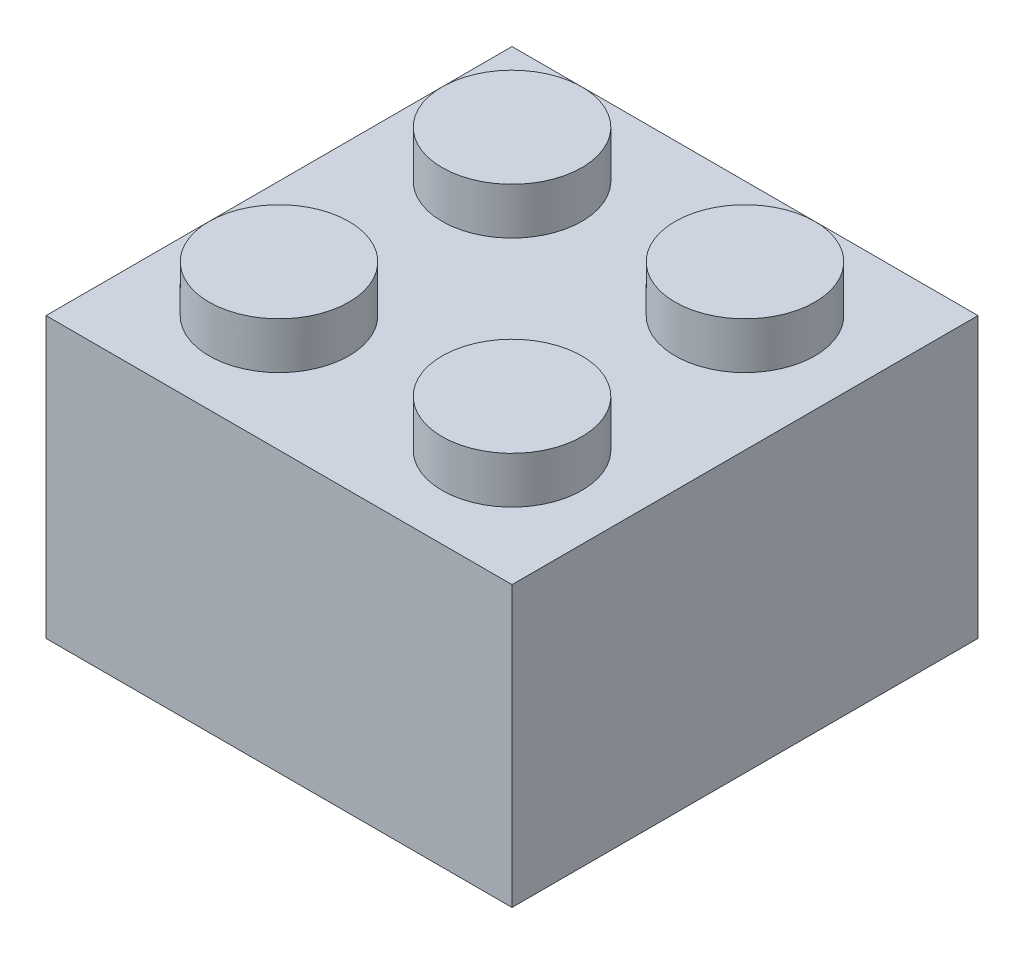
ISO-10303-21;
HEADER;
FILE_DESCRIPTION(('STEP AP214'),'2;1');
FILE_NAME('part.step','',(''),(''),'','','');
FILE_SCHEMA(('AUTOMOTIVE_DESIGN { 1 0 10303 214 1 1 1 1 }'));
ENDSEC;
DATA;
#1=APPLICATION_CONTEXT('core data for automotive mechanical design processes');
#2=APPLICATION_PROTOCOL_DEFINITION('international standard','automotive_design',2000,#1);
#3=PRODUCT_CONTEXT('',#1,'mechanical');
#4=PRODUCT('Part','Part','',(#3));
#5=PRODUCT_RELATED_PRODUCT_CATEGORY('part','',(#4));
#6=PRODUCT_DEFINITION_FORMATION('','',#4);
#7=PRODUCT_DEFINITION_CONTEXT('part definition',#1,'design');
#8=PRODUCT_DEFINITION('design','',#6,#7);
#9=PRODUCT_DEFINITION_SHAPE('','',#8);
#10=(LENGTH_UNIT() NAMED_UNIT(*) SI_UNIT(.MILLI.,.METRE.));
#11=(NAMED_UNIT(*) PLANE_ANGLE_UNIT() SI_UNIT($,.RADIAN.));
#12=(NAMED_UNIT(*) SI_UNIT($,.STERADIAN.) SOLID_ANGLE_UNIT());
#13=UNCERTAINTY_MEASURE_WITH_UNIT(LENGTH_MEASURE(1.E-05),#10,'distance_accuracy_value','');
#14=(GEOMETRIC_REPRESENTATION_CONTEXT(3) GLOBAL_UNCERTAINTY_ASSIGNED_CONTEXT((#13)) GLOBAL_UNIT_ASSIGNED_CONTEXT((#10,
#11,#12)) REPRESENTATION_CONTEXT('',''));
#15=CARTESIAN_POINT('',(0.,0.,0.));
#16=DIRECTION('',(0.,0.,1.));
#17=DIRECTION('',(1.,0.,0.));
#18=AXIS2_PLACEMENT_3D('',#15,#16,#17);
#19=CARTESIAN_POINT('',(1.,5.,500000.));
#20=DIRECTION('',(0.,1.,0.));
#21=DIRECTION('',(0.,0.,1.));
#22=AXIS2_PLACEMENT_3D('',#19,#20,#21);
#23=PLANE('',#22);
#24=CARTESIAN_POINT('',(2.5,5.,-7.5));
#25=DIRECTION('',(0.,-1.,0.));
#26=DIRECTION('',(0.,0.,-1.));
#27=AXIS2_PLACEMENT_3D('',#24,#25,#26);
#28=CIRCLE('',#27,0.75);
#29=CARTESIAN_POINT('',(2.5,5.,-8.25));
#30=VERTEX_POINT('',#29);
#31=EDGE_CURVE('E256',#30,#30,#28,.F.);
#32=ORIENTED_EDGE('',*,*,#31,.T.);
#33=EDGE_LOOP('',(#32));
#34=FACE_BOUND('',#33,.T.);
#35=DIRECTION('',(0.,0.,-1.));
#36=VECTOR('',#35,1.);
#37=CARTESIAN_POINT('',(9.,5.,500000.));
#38=LINE('',#37,#36);
#39=CARTESIAN_POINT('',(9.,5.,-0.999999999976353));
#40=VERTEX_POINT('',#39);
#41=CARTESIAN_POINT('',(9.,5.,-9.));
#42=VERTEX_POINT('',#41);
#43=EDGE_CURVE('E102',#40,#42,#38,.T.);
#44=ORIENTED_EDGE('',*,*,#43,.F.);
#45=DIRECTION('',(-1.,0.,0.));
#46=VECTOR('',#45,1.);
#47=CARTESIAN_POINT('',(1.,5.,-0.999999999976353));
#48=LINE('',#47,#46);
#49=CARTESIAN_POINT('',(1.,5.,-0.999999999976353));
#50=VERTEX_POINT('',#49);
#51=EDGE_CURVE('E99',#40,#50,#48,.T.);
#52=ORIENTED_EDGE('',*,*,#51,.T.);
#53=DIRECTION('',(0.,0.,-1.));
#54=VECTOR('',#53,1.);
#55=CARTESIAN_POINT('',(1.,5.,500000.));
#56=LINE('',#55,#54);
#57=CARTESIAN_POINT('',(1.,5.,-9.));
#58=VERTEX_POINT('',#57);
#59=EDGE_CURVE('E50',#50,#58,#56,.T.);
#60=ORIENTED_EDGE('',*,*,#59,.T.);
#61=DIRECTION('',(1.,0.,0.));
#62=VECTOR('',#61,1.);
#63=CARTESIAN_POINT('',(1.,5.,-9.));
#64=LINE('',#63,#62);
#65=EDGE_CURVE('E210',#58,#42,#64,.T.);
#66=ORIENTED_EDGE('',*,*,#65,.T.);
#67=EDGE_LOOP('',(#44,#52,#60,#66));
#68=FACE_BOUND('',#67,.T.);
#69=CARTESIAN_POINT('',(5.,5.,-4.99999999998818));
#70=DIRECTION('',(0.,1.,0.));
#71=DIRECTION('',(0.,0.,1.));
#72=AXIS2_PLACEMENT_3D('',#69,#70,#71);
#73=CIRCLE('',#72,2.03553390593274);
#74=CARTESIAN_POINT('',(5.,5.,-2.96446609405544));
#75=VERTEX_POINT('',#74);
#76=EDGE_CURVE('E11',#75,#75,#73,.F.);
#77=ORIENTED_EDGE('',*,*,#76,.F.);
#78=EDGE_LOOP('',(#77));
#79=FACE_BOUND('',#78,.T.);
#80=CARTESIAN_POINT('',(7.5,5.,-7.5));
#81=DIRECTION('',(0.,-1.,0.));
#82=DIRECTION('',(0.,0.,-1.));
#83=AXIS2_PLACEMENT_3D('',#80,#81,#82);
#84=CIRCLE('',#83,0.75);
#85=CARTESIAN_POINT('',(7.5,5.,-8.25));
#86=VERTEX_POINT('',#85);
#87=EDGE_CURVE('E238',#86,#86,#84,.T.);
#88=ORIENTED_EDGE('',*,*,#87,.F.);
#89=EDGE_LOOP('',(#88));
#90=FACE_BOUND('',#89,.T.);
#91=CARTESIAN_POINT('',(7.5,5.,-2.5));
#92=DIRECTION('',(0.,-1.,0.));
#93=DIRECTION('',(0.,0.,-1.));
#94=AXIS2_PLACEMENT_3D('',#91,#92,#93);
#95=CIRCLE('',#94,0.75);
#96=CARTESIAN_POINT('',(7.5,5.,-3.25));
#97=VERTEX_POINT('',#96);
#98=EDGE_CURVE('E244',#97,#97,#95,.F.);
#99=ORIENTED_EDGE('',*,*,#98,.T.);
#100=EDGE_LOOP('',(#99));
#101=FACE_BOUND('',#100,.T.);
#102=CARTESIAN_POINT('',(2.5,5.,-2.5));
#103=DIRECTION('',(0.,-1.,0.));
#104=DIRECTION('',(0.,0.,-1.));
#105=AXIS2_PLACEMENT_3D('',#102,#103,#104);
#106=CIRCLE('',#105,0.75);
#107=CARTESIAN_POINT('',(2.5,5.,-3.25));
#108=VERTEX_POINT('',#107);
#109=EDGE_CURVE('E250',#108,#108,#106,.T.);
#110=ORIENTED_EDGE('',*,*,#109,.F.);
#111=EDGE_LOOP('',(#110));
#112=FACE_BOUND('',#111,.T.);
#113=ADVANCED_FACE('F35',(#34,#68,#79,#90,#101,#112),#23,.F.);
#114=CARTESIAN_POINT('',(1.,6.,-1.));
#115=DIRECTION('',(1.,0.,0.));
#116=DIRECTION('',(0.,0.,-1.));
#117=AXIS2_PLACEMENT_3D('',#114,#115,#116);
#118=PLANE('',#117);
#119=DIRECTION('',(0.,-1.,0.));
#120=VECTOR('',#119,1.);
#121=CARTESIAN_POINT('',(1.,6.,-9.));
#122=LINE('',#121,#120);
#123=CARTESIAN_POINT('',(1.,0.,-9.));
#124=VERTEX_POINT('',#123);
#125=EDGE_CURVE('E57',#58,#124,#122,.T.);
#126=ORIENTED_EDGE('',*,*,#125,.F.);
#127=ORIENTED_EDGE('',*,*,#59,.F.);
#128=DIRECTION('',(0.,-1.,0.));
#129=VECTOR('',#128,1.);
#130=CARTESIAN_POINT('',(1.,6.,-1.));
#131=LINE('',#130,#129);
#132=CARTESIAN_POINT('',(1.,0.,-1.));
#133=VERTEX_POINT('',#132);
#134=EDGE_CURVE('E110',#50,#133,#131,.T.);
#135=ORIENTED_EDGE('',*,*,#134,.T.);
#136=DIRECTION('',(0.,0.,1.));
#137=VECTOR('',#136,1.);
#138=CARTESIAN_POINT('',(1.,0.,-1.));
#139=LINE('',#138,#137);
#140=EDGE_CURVE('E200',#124,#133,#139,.T.);
#141=ORIENTED_EDGE('',*,*,#140,.F.);
#142=EDGE_LOOP('',(#126,#127,#135,#141));
#143=FACE_BOUND('',#142,.T.);
#144=ADVANCED_FACE('F109',(#143),#118,.T.);
#145=CARTESIAN_POINT('',(1.,6.,-1.));
#146=DIRECTION('',(0.,0.,-1.));
#147=DIRECTION('',(-1.,0.,0.));
#148=AXIS2_PLACEMENT_3D('',#145,#146,#147);
#149=PLANE('',#148);
#150=ORIENTED_EDGE('',*,*,#134,.F.);
#151=ORIENTED_EDGE('',*,*,#51,.F.);
#152=DIRECTION('',(0.,-1.,0.));
#153=VECTOR('',#152,1.);
#154=CARTESIAN_POINT('',(9.,6.,-1.));
#155=LINE('',#154,#153);
#156=CARTESIAN_POINT('',(9.,0.,-1.));
#157=VERTEX_POINT('',#156);
#158=EDGE_CURVE('E118',#40,#157,#155,.T.);
#159=ORIENTED_EDGE('',*,*,#158,.T.);
#160=DIRECTION('',(1.,0.,0.));
#161=VECTOR('',#160,1.);
#162=CARTESIAN_POINT('',(1.,0.,-1.));
#163=LINE('',#162,#161);
#164=EDGE_CURVE('E115',#133,#157,#163,.T.);
#165=ORIENTED_EDGE('',*,*,#164,.F.);
#166=EDGE_LOOP('',(#150,#151,#159,#165));
#167=FACE_BOUND('',#166,.T.);
#168=ADVANCED_FACE('F113',(#167),#149,.T.);
#169=CARTESIAN_POINT('',(9.,6.,-1.));
#170=DIRECTION('',(-1.,0.,0.));
#171=DIRECTION('',(0.,0.,1.));
#172=AXIS2_PLACEMENT_3D('',#169,#170,#171);
#173=PLANE('',#172);
#174=ORIENTED_EDGE('',*,*,#158,.F.);
#175=ORIENTED_EDGE('',*,*,#43,.T.);
#176=DIRECTION('',(0.,-1.,0.));
#177=VECTOR('',#176,1.);
#178=CARTESIAN_POINT('',(9.,6.,-9.));
#179=LINE('',#178,#177);
#180=CARTESIAN_POINT('',(9.,0.,-9.));
#181=VERTEX_POINT('',#180);
#182=EDGE_CURVE('E123',#42,#181,#179,.T.);
#183=ORIENTED_EDGE('',*,*,#182,.T.);
#184=DIRECTION('',(0.,0.,-1.));
#185=VECTOR('',#184,1.);
#186=CARTESIAN_POINT('',(9.,0.,-1.));
#187=LINE('',#186,#185);
#188=EDGE_CURVE('E202',#157,#181,#187,.T.);
#189=ORIENTED_EDGE('',*,*,#188,.F.);
#190=EDGE_LOOP('',(#174,#175,#183,#189));
#191=FACE_BOUND('',#190,.T.);
#192=ADVANCED_FACE('F209',(#191),#173,.T.);
#193=CARTESIAN_POINT('',(1.,6.,-9.));
#194=DIRECTION('',(0.,0.,1.));
#195=DIRECTION('',(1.,0.,0.));
#196=AXIS2_PLACEMENT_3D('',#193,#194,#195);
#197=PLANE('',#196);
#198=ORIENTED_EDGE('',*,*,#182,.F.);
#199=ORIENTED_EDGE('',*,*,#65,.F.);
#200=ORIENTED_EDGE('',*,*,#125,.T.);
#201=DIRECTION('',(-1.,0.,0.));
#202=VECTOR('',#201,1.);
#203=CARTESIAN_POINT('',(1.,0.,-9.));
#204=LINE('',#203,#202);
#205=EDGE_CURVE('E199',#181,#124,#204,.T.);
#206=ORIENTED_EDGE('',*,*,#205,.F.);
#207=EDGE_LOOP('',(#198,#199,#200,#206));
#208=FACE_BOUND('',#207,.T.);
#209=ADVANCED_FACE('F164',(#208),#197,.T.);
#210=CARTESIAN_POINT('',(0.,6.,0.));
#211=DIRECTION('',(0.,-1.,0.));
#212=DIRECTION('',(0.,0.,-1.));
#213=AXIS2_PLACEMENT_3D('',#210,#211,#212);
#214=PLANE('',#213);
#215=CARTESIAN_POINT('',(2.5,6.,-2.5));
#216=DIRECTION('',(0.,-1.,0.));
#217=DIRECTION('',(0.,0.,-1.));
#218=AXIS2_PLACEMENT_3D('',#215,#216,#217);
#219=CIRCLE('',#218,1.5);
#220=CARTESIAN_POINT('',(2.5,6.,-4.));
#221=VERTEX_POINT('',#220);
#222=EDGE_CURVE('E43',#221,#221,#219,.F.);
#223=ORIENTED_EDGE('',*,*,#222,.F.);
#224=EDGE_LOOP('',(#223));
#225=FACE_BOUND('',#224,.T.);
#226=CARTESIAN_POINT('',(7.5,6.,-2.5));
#227=DIRECTION('',(0.,1.,0.));
#228=DIRECTION('',(0.,0.,1.));
#229=AXIS2_PLACEMENT_3D('',#226,#227,#228);
#230=CIRCLE('',#229,1.5);
#231=CARTESIAN_POINT('',(7.5,6.,-1.));
#232=VERTEX_POINT('',#231);
#233=EDGE_CURVE('E169',#232,#232,#230,.F.);
#234=ORIENTED_EDGE('',*,*,#233,.T.);
#235=EDGE_LOOP('',(#234));
#236=FACE_BOUND('',#235,.T.);
#237=CARTESIAN_POINT('',(7.5,6.,-7.5));
#238=DIRECTION('',(0.,-1.,0.));
#239=DIRECTION('',(0.,0.,-1.));
#240=AXIS2_PLACEMENT_3D('',#237,#238,#239);
#241=CIRCLE('',#240,1.5);
#242=CARTESIAN_POINT('',(7.5,6.,-9.));
#243=VERTEX_POINT('',#242);
#244=EDGE_CURVE('E153',#243,#243,#241,.F.);
#245=ORIENTED_EDGE('',*,*,#244,.F.);
#246=EDGE_LOOP('',(#245));
#247=FACE_BOUND('',#246,.T.);
#248=CARTESIAN_POINT('',(2.5,6.,-7.5));
#249=DIRECTION('',(0.,1.,0.));
#250=DIRECTION('',(0.,0.,1.));
#251=AXIS2_PLACEMENT_3D('',#248,#249,#250);
#252=CIRCLE('',#251,1.5);
#253=CARTESIAN_POINT('',(2.5,6.,-6.));
#254=VERTEX_POINT('',#253);
#255=EDGE_CURVE('E175',#254,#254,#252,.F.);
#256=ORIENTED_EDGE('',*,*,#255,.T.);
#257=EDGE_LOOP('',(#256));
#258=FACE_BOUND('',#257,.T.);
#259=DIRECTION('',(0.,0.,1.));
#260=VECTOR('',#259,1.);
#261=CARTESIAN_POINT('',(0.,6.,0.));
#262=LINE('',#261,#260);
#263=CARTESIAN_POINT('',(0.,6.,-10.));
#264=VERTEX_POINT('',#263);
#265=CARTESIAN_POINT('',(0.,6.,0.));
#266=VERTEX_POINT('',#265);
#267=EDGE_CURVE('E127',#264,#266,#262,.T.);
#268=ORIENTED_EDGE('',*,*,#267,.T.);
#269=DIRECTION('',(1.,0.,0.));
#270=VECTOR('',#269,1.);
#271=CARTESIAN_POINT('',(0.,6.,0.));
#272=LINE('',#271,#270);
#273=CARTESIAN_POINT('',(10.,6.,0.));
#274=VERTEX_POINT('',#273);
#275=EDGE_CURVE('E130',#266,#274,#272,.T.);
#276=ORIENTED_EDGE('',*,*,#275,.T.);
#277=DIRECTION('',(0.,0.,-1.));
#278=VECTOR('',#277,1.);
#279=CARTESIAN_POINT('',(10.,6.,0.));
#280=LINE('',#279,#278);
#281=CARTESIAN_POINT('',(10.,6.,-10.));
#282=VERTEX_POINT('',#281);
#283=EDGE_CURVE('E133',#274,#282,#280,.T.);
#284=ORIENTED_EDGE('',*,*,#283,.T.);
#285=DIRECTION('',(-1.,0.,0.));
#286=VECTOR('',#285,1.);
#287=CARTESIAN_POINT('',(0.,6.,-10.));
#288=LINE('',#287,#286);
#289=EDGE_CURVE('E135',#282,#264,#288,.T.);
#290=ORIENTED_EDGE('',*,*,#289,.T.);
#291=EDGE_LOOP('',(#268,#276,#284,#290));
#292=FACE_BOUND('',#291,.T.);
#293=ADVANCED_FACE('F160',(#225,#236,#247,#258,#292),#214,.F.);
#294=CARTESIAN_POINT('',(0.,0.,0.));
#295=DIRECTION('',(0.,-1.,0.));
#296=DIRECTION('',(0.,0.,-1.));
#297=AXIS2_PLACEMENT_3D('',#294,#295,#296);
#298=PLANE('',#297);
#299=DIRECTION('',(0.,0.,1.));
#300=VECTOR('',#299,1.);
#301=CARTESIAN_POINT('',(0.,0.,0.));
#302=LINE('',#301,#300);
#303=CARTESIAN_POINT('',(0.,0.,-10.));
#304=VERTEX_POINT('',#303);
#305=CARTESIAN_POINT('',(0.,0.,0.));
#306=VERTEX_POINT('',#305);
#307=EDGE_CURVE('E117',#304,#306,#302,.T.);
#308=ORIENTED_EDGE('',*,*,#307,.F.);
#309=DIRECTION('',(-1.,0.,0.));
#310=VECTOR('',#309,1.);
#311=CARTESIAN_POINT('',(0.,0.,-10.));
#312=LINE('',#311,#310);
#313=CARTESIAN_POINT('',(10.,0.,-10.));
#314=VERTEX_POINT('',#313);
#315=EDGE_CURVE('E131',#314,#304,#312,.T.);
#316=ORIENTED_EDGE('',*,*,#315,.F.);
#317=DIRECTION('',(0.,0.,-1.));
#318=VECTOR('',#317,1.);
#319=CARTESIAN_POINT('',(10.,0.,0.));
#320=LINE('',#319,#318);
#321=CARTESIAN_POINT('',(10.,0.,0.));
#322=VERTEX_POINT('',#321);
#323=EDGE_CURVE('E139',#322,#314,#320,.T.);
#324=ORIENTED_EDGE('',*,*,#323,.F.);
#325=DIRECTION('',(1.,0.,0.));
#326=VECTOR('',#325,1.);
#327=CARTESIAN_POINT('',(0.,0.,0.));
#328=LINE('',#327,#326);
#329=EDGE_CURVE('E121',#306,#322,#328,.T.);
#330=ORIENTED_EDGE('',*,*,#329,.F.);
#331=EDGE_LOOP('',(#308,#316,#324,#330));
#332=FACE_BOUND('',#331,.T.);
#333=ORIENTED_EDGE('',*,*,#205,.T.);
#334=ORIENTED_EDGE('',*,*,#140,.T.);
#335=ORIENTED_EDGE('',*,*,#164,.T.);
#336=ORIENTED_EDGE('',*,*,#188,.T.);
#337=EDGE_LOOP('',(#333,#334,#335,#336));
#338=FACE_BOUND('',#337,.T.);
#339=ADVANCED_FACE('F163',(#332,#338),#298,.T.);
#340=CARTESIAN_POINT('',(0.,6.,0.));
#341=DIRECTION('',(1.,0.,0.));
#342=DIRECTION('',(0.,0.,-1.));
#343=AXIS2_PLACEMENT_3D('',#340,#341,#342);
#344=PLANE('',#343);
#345=ORIENTED_EDGE('',*,*,#307,.T.);
#346=DIRECTION('',(0.,-1.,0.));
#347=VECTOR('',#346,1.);
#348=CARTESIAN_POINT('',(0.,6.,0.));
#349=LINE('',#348,#347);
#350=EDGE_CURVE('E150',#266,#306,#349,.T.);
#351=ORIENTED_EDGE('',*,*,#350,.F.);
#352=ORIENTED_EDGE('',*,*,#267,.F.);
#353=DIRECTION('',(0.,-1.,0.));
#354=VECTOR('',#353,1.);
#355=CARTESIAN_POINT('',(0.,6.,-10.));
#356=LINE('',#355,#354);
#357=EDGE_CURVE('E136',#264,#304,#356,.T.);
#358=ORIENTED_EDGE('',*,*,#357,.T.);
#359=EDGE_LOOP('',(#345,#351,#352,#358));
#360=FACE_BOUND('',#359,.T.);
#361=ADVANCED_FACE('F37',(#360),#344,.F.);
#362=CARTESIAN_POINT('',(0.,6.,0.));
#363=DIRECTION('',(0.,0.,-1.));
#364=DIRECTION('',(-1.,0.,0.));
#365=AXIS2_PLACEMENT_3D('',#362,#363,#364);
#366=PLANE('',#365);
#367=ORIENTED_EDGE('',*,*,#329,.T.);
#368=DIRECTION('',(0.,-1.,0.));
#369=VECTOR('',#368,1.);
#370=CARTESIAN_POINT('',(10.,6.,0.));
#371=LINE('',#370,#369);
#372=EDGE_CURVE('E147',#274,#322,#371,.T.);
#373=ORIENTED_EDGE('',*,*,#372,.F.);
#374=ORIENTED_EDGE('',*,*,#275,.F.);
#375=ORIENTED_EDGE('',*,*,#350,.T.);
#376=EDGE_LOOP('',(#367,#373,#374,#375));
#377=FACE_BOUND('',#376,.T.);
#378=ADVANCED_FACE('F184',(#377),#366,.F.);
#379=CARTESIAN_POINT('',(10.,6.,0.));
#380=DIRECTION('',(-1.,0.,0.));
#381=DIRECTION('',(0.,0.,1.));
#382=AXIS2_PLACEMENT_3D('',#379,#380,#381);
#383=PLANE('',#382);
#384=ORIENTED_EDGE('',*,*,#323,.T.);
#385=DIRECTION('',(0.,-1.,0.));
#386=VECTOR('',#385,1.);
#387=CARTESIAN_POINT('',(10.,6.,-10.));
#388=LINE('',#387,#386);
#389=EDGE_CURVE('E144',#282,#314,#388,.T.);
#390=ORIENTED_EDGE('',*,*,#389,.F.);
#391=ORIENTED_EDGE('',*,*,#283,.F.);
#392=ORIENTED_EDGE('',*,*,#372,.T.);
#393=EDGE_LOOP('',(#384,#390,#391,#392));
#394=FACE_BOUND('',#393,.T.);
#395=ADVANCED_FACE('F189',(#394),#383,.F.);
#396=CARTESIAN_POINT('',(0.,6.,-10.));
#397=DIRECTION('',(0.,0.,1.));
#398=DIRECTION('',(1.,0.,0.));
#399=AXIS2_PLACEMENT_3D('',#396,#397,#398);
#400=PLANE('',#399);
#401=ORIENTED_EDGE('',*,*,#315,.T.);
#402=ORIENTED_EDGE('',*,*,#357,.F.);
#403=ORIENTED_EDGE('',*,*,#289,.F.);
#404=ORIENTED_EDGE('',*,*,#389,.T.);
#405=EDGE_LOOP('',(#401,#402,#403,#404));
#406=FACE_BOUND('',#405,.T.);
#407=ADVANCED_FACE('F192',(#406),#400,.F.);
#408=CARTESIAN_POINT('',(2.5,7.,-7.5));
#409=DIRECTION('',(0.,-1.,0.));
#410=DIRECTION('',(0.,0.,-1.));
#411=AXIS2_PLACEMENT_3D('',#408,#409,#410);
#412=CYLINDRICAL_SURFACE('',#411,1.5);
#413=CARTESIAN_POINT('',(2.5,7.,-7.5));
#414=DIRECTION('',(0.,1.,0.));
#415=DIRECTION('',(0.,0.,1.));
#416=AXIS2_PLACEMENT_3D('',#413,#414,#415);
#417=CIRCLE('',#416,1.5);
#418=CARTESIAN_POINT('',(2.5,7.,-6.));
#419=VERTEX_POINT('',#418);
#420=EDGE_CURVE('E106',#419,#419,#417,.F.);
#421=ORIENTED_EDGE('',*,*,#420,.T.);
#422=EDGE_LOOP('',(#421));
#423=FACE_BOUND('',#422,.T.);
#424=ORIENTED_EDGE('',*,*,#255,.F.);
#425=EDGE_LOOP('',(#424));
#426=FACE_BOUND('',#425,.T.);
#427=ADVANCED_FACE('F338',(#423,#426),#412,.T.);
#428=CARTESIAN_POINT('',(0.,7.,0.));
#429=DIRECTION('',(0.,1.,0.));
#430=DIRECTION('',(0.,0.,1.));
#431=AXIS2_PLACEMENT_3D('',#428,#429,#430);
#432=PLANE('',#431);
#433=ORIENTED_EDGE('',*,*,#420,.F.);
#434=EDGE_LOOP('',(#433));
#435=FACE_BOUND('',#434,.T.);
#436=ADVANCED_FACE('F335',(#435),#432,.T.);
#437=CARTESIAN_POINT('',(7.5,7.,-7.5));
#438=DIRECTION('',(0.,-1.,0.));
#439=DIRECTION('',(0.,0.,-1.));
#440=AXIS2_PLACEMENT_3D('',#437,#438,#439);
#441=CYLINDRICAL_SURFACE('',#440,1.5);
#442=CARTESIAN_POINT('',(7.5,7.,-7.5));
#443=DIRECTION('',(0.,1.,0.));
#444=DIRECTION('',(0.,0.,1.));
#445=AXIS2_PLACEMENT_3D('',#442,#443,#444);
#446=CIRCLE('',#445,1.5);
#447=CARTESIAN_POINT('',(7.5,7.,-6.));
#448=VERTEX_POINT('',#447);
#449=EDGE_CURVE('E216',#448,#448,#446,.T.);
#450=ORIENTED_EDGE('',*,*,#449,.F.);
#451=EDGE_LOOP('',(#450));
#452=FACE_BOUND('',#451,.T.);
#453=ORIENTED_EDGE('',*,*,#244,.T.);
#454=EDGE_LOOP('',(#453));
#455=FACE_BOUND('',#454,.T.);
#456=ADVANCED_FACE('F331',(#452,#455),#441,.T.);
#457=CARTESIAN_POINT('',(0.,7.,0.));
#458=DIRECTION('',(0.,1.,0.));
#459=DIRECTION('',(0.,0.,1.));
#460=AXIS2_PLACEMENT_3D('',#457,#458,#459);
#461=PLANE('',#460);
#462=ORIENTED_EDGE('',*,*,#449,.T.);
#463=EDGE_LOOP('',(#462));
#464=FACE_BOUND('',#463,.T.);
#465=ADVANCED_FACE('F327',(#464),#461,.T.);
#466=CARTESIAN_POINT('',(7.5,7.,-2.5));
#467=DIRECTION('',(0.,-1.,0.));
#468=DIRECTION('',(0.,0.,-1.));
#469=AXIS2_PLACEMENT_3D('',#466,#467,#468);
#470=CYLINDRICAL_SURFACE('',#469,1.5);
#471=CARTESIAN_POINT('',(7.5,7.,-2.5));
#472=DIRECTION('',(0.,1.,0.));
#473=DIRECTION('',(0.,0.,1.));
#474=AXIS2_PLACEMENT_3D('',#471,#472,#473);
#475=CIRCLE('',#474,1.5);
#476=CARTESIAN_POINT('',(7.5,7.,-1.));
#477=VERTEX_POINT('',#476);
#478=EDGE_CURVE('E221',#477,#477,#475,.F.);
#479=ORIENTED_EDGE('',*,*,#478,.T.);
#480=EDGE_LOOP('',(#479));
#481=FACE_BOUND('',#480,.T.);
#482=ORIENTED_EDGE('',*,*,#233,.F.);
#483=EDGE_LOOP('',(#482));
#484=FACE_BOUND('',#483,.T.);
#485=ADVANCED_FACE('F323',(#481,#484),#470,.T.);
#486=CARTESIAN_POINT('',(0.,7.,0.));
#487=DIRECTION('',(0.,1.,0.));
#488=DIRECTION('',(0.,0.,1.));
#489=AXIS2_PLACEMENT_3D('',#486,#487,#488);
#490=PLANE('',#489);
#491=ORIENTED_EDGE('',*,*,#478,.F.);
#492=EDGE_LOOP('',(#491));
#493=FACE_BOUND('',#492,.T.);
#494=ADVANCED_FACE('F319',(#493),#490,.T.);
#495=CARTESIAN_POINT('',(2.5,7.,-2.5));
#496=DIRECTION('',(0.,-1.,0.));
#497=DIRECTION('',(0.,0.,-1.));
#498=AXIS2_PLACEMENT_3D('',#495,#496,#497);
#499=CYLINDRICAL_SURFACE('',#498,1.5);
#500=CARTESIAN_POINT('',(2.5,7.,-2.5));
#501=DIRECTION('',(0.,1.,0.));
#502=DIRECTION('',(0.,0.,1.));
#503=AXIS2_PLACEMENT_3D('',#500,#501,#502);
#504=CIRCLE('',#503,1.5);
#505=CARTESIAN_POINT('',(2.5,7.,-1.));
#506=VERTEX_POINT('',#505);
#507=EDGE_CURVE('E223',#506,#506,#504,.T.);
#508=ORIENTED_EDGE('',*,*,#507,.F.);
#509=EDGE_LOOP('',(#508));
#510=FACE_BOUND('',#509,.T.);
#511=ORIENTED_EDGE('',*,*,#222,.T.);
#512=EDGE_LOOP('',(#511));
#513=FACE_BOUND('',#512,.T.);
#514=ADVANCED_FACE('F158',(#510,#513),#499,.T.);
#515=CARTESIAN_POINT('',(0.,7.,0.));
#516=DIRECTION('',(0.,1.,0.));
#517=DIRECTION('',(0.,0.,1.));
#518=AXIS2_PLACEMENT_3D('',#515,#516,#517);
#519=PLANE('',#518);
#520=ORIENTED_EDGE('',*,*,#507,.T.);
#521=EDGE_LOOP('',(#520));
#522=FACE_BOUND('',#521,.T.);
#523=ADVANCED_FACE('F302',(#522),#519,.T.);
#524=CARTESIAN_POINT('',(5.,-5.75735931288072,-4.99999999998818));
#525=DIRECTION('',(0.,1.,0.));
#526=DIRECTION('',(0.,0.,1.));
#527=AXIS2_PLACEMENT_3D('',#524,#525,#526);
#528=CYLINDRICAL_SURFACE('',#527,1.5);
#529=CARTESIAN_POINT('',(5.,5.,-4.99999999998818));
#530=DIRECTION('',(0.,-1.,0.));
#531=DIRECTION('',(0.,0.,-1.));
#532=AXIS2_PLACEMENT_3D('',#529,#530,#531);
#533=CIRCLE('',#532,1.5);
#534=CARTESIAN_POINT('',(5.,5.,-6.49999999998818));
#535=VERTEX_POINT('',#534);
#536=EDGE_CURVE('E232',#535,#535,#533,.T.);
#537=ORIENTED_EDGE('',*,*,#536,.F.);
#538=EDGE_LOOP('',(#537));
#539=FACE_BOUND('',#538,.T.);
#540=CARTESIAN_POINT('',(5.,0.,-4.99999999998818));
#541=DIRECTION('',(0.,-1.,0.));
#542=DIRECTION('',(0.,0.,-1.));
#543=AXIS2_PLACEMENT_3D('',#540,#541,#542);
#544=CIRCLE('',#543,1.5);
#545=CARTESIAN_POINT('',(5.,0.,-6.49999999998818));
#546=VERTEX_POINT('',#545);
#547=EDGE_CURVE('E229',#546,#546,#544,.T.);
#548=ORIENTED_EDGE('',*,*,#547,.T.);
#549=EDGE_LOOP('',(#548));
#550=FACE_BOUND('',#549,.T.);
#551=ADVANCED_FACE('F299',(#539,#550),#528,.F.);
#552=CARTESIAN_POINT('',(5.,-5.75735931288072,-4.99999999998818));
#553=DIRECTION('',(0.,1.,0.));
#554=DIRECTION('',(0.,0.,1.));
#555=AXIS2_PLACEMENT_3D('',#552,#553,#554);
#556=CYLINDRICAL_SURFACE('',#555,2.03553390593274);
#557=ORIENTED_EDGE('',*,*,#76,.T.);
#558=EDGE_LOOP('',(#557));
#559=FACE_BOUND('',#558,.T.);
#560=CARTESIAN_POINT('',(5.,0.,-4.99999999998818));
#561=DIRECTION('',(0.,-1.,0.));
#562=DIRECTION('',(0.,0.,-1.));
#563=AXIS2_PLACEMENT_3D('',#560,#561,#562);
#564=CIRCLE('',#563,2.03553390593274);
#565=CARTESIAN_POINT('',(5.,0.,-7.03553390592092));
#566=VERTEX_POINT('',#565);
#567=EDGE_CURVE('E228',#566,#566,#564,.T.);
#568=ORIENTED_EDGE('',*,*,#567,.F.);
#569=EDGE_LOOP('',(#568));
#570=FACE_BOUND('',#569,.T.);
#571=ADVANCED_FACE('F294',(#559,#570),#556,.T.);
#572=CARTESIAN_POINT('',(0.,0.,0.));
#573=DIRECTION('',(0.,-1.,0.));
#574=DIRECTION('',(0.,0.,-1.));
#575=AXIS2_PLACEMENT_3D('',#572,#573,#574);
#576=PLANE('',#575);
#577=ORIENTED_EDGE('',*,*,#547,.F.);
#578=EDGE_LOOP('',(#577));
#579=FACE_BOUND('',#578,.T.);
#580=ORIENTED_EDGE('',*,*,#567,.T.);
#581=EDGE_LOOP('',(#580));
#582=FACE_BOUND('',#581,.T.);
#583=ADVANCED_FACE('F285',(#579,#582),#576,.T.);
#584=ORIENTED_EDGE('',*,*,#536,.T.);
#585=EDGE_LOOP('',(#584));
#586=FACE_BOUND('',#585,.T.);
#587=ADVANCED_FACE('F276',(#586),#23,.F.);
#588=CARTESIAN_POINT('',(7.5,6.,-7.5));
#589=DIRECTION('',(0.,-1.,0.));
#590=DIRECTION('',(0.,0.,-1.));
#591=AXIS2_PLACEMENT_3D('',#588,#589,#590);
#592=CYLINDRICAL_SURFACE('',#591,0.75);
#593=CARTESIAN_POINT('',(7.5,6.,-7.5));
#594=DIRECTION('',(0.,-1.,0.));
#595=DIRECTION('',(0.,0.,-1.));
#596=AXIS2_PLACEMENT_3D('',#593,#594,#595);
#597=CIRCLE('',#596,0.75);
#598=CARTESIAN_POINT('',(7.5,6.,-8.25));
#599=VERTEX_POINT('',#598);
#600=EDGE_CURVE('E233',#599,#599,#597,.T.);
#601=ORIENTED_EDGE('',*,*,#600,.F.);
#602=EDGE_LOOP('',(#601));
#603=FACE_BOUND('',#602,.T.);
#604=ORIENTED_EDGE('',*,*,#87,.T.);
#605=EDGE_LOOP('',(#604));
#606=FACE_BOUND('',#605,.T.);
#607=ADVANCED_FACE('F284',(#603,#606),#592,.F.);
#608=CARTESIAN_POINT('',(0.,6.,0.));
#609=DIRECTION('',(0.,-1.,0.));
#610=DIRECTION('',(0.,0.,-1.));
#611=AXIS2_PLACEMENT_3D('',#608,#609,#610);
#612=PLANE('',#611);
#613=ORIENTED_EDGE('',*,*,#600,.T.);
#614=EDGE_LOOP('',(#613));
#615=FACE_BOUND('',#614,.T.);
#616=ADVANCED_FACE('F291',(#615),#612,.T.);
#617=CARTESIAN_POINT('',(7.5,6.,-2.5));
#618=DIRECTION('',(0.,-1.,0.));
#619=DIRECTION('',(0.,0.,-1.));
#620=AXIS2_PLACEMENT_3D('',#617,#618,#619);
#621=CYLINDRICAL_SURFACE('',#620,0.75);
#622=CARTESIAN_POINT('',(7.5,6.,-2.5));
#623=DIRECTION('',(0.,-1.,0.));
#624=DIRECTION('',(0.,0.,-1.));
#625=AXIS2_PLACEMENT_3D('',#622,#623,#624);
#626=CIRCLE('',#625,0.75);
#627=CARTESIAN_POINT('',(7.5,6.,-3.25));
#628=VERTEX_POINT('',#627);
#629=EDGE_CURVE('E247',#628,#628,#626,.F.);
#630=ORIENTED_EDGE('',*,*,#629,.T.);
#631=EDGE_LOOP('',(#630));
#632=FACE_BOUND('',#631,.T.);
#633=ORIENTED_EDGE('',*,*,#98,.F.);
#634=EDGE_LOOP('',(#633));
#635=FACE_BOUND('',#634,.T.);
#636=ADVANCED_FACE('F492',(#632,#635),#621,.F.);
#637=CARTESIAN_POINT('',(0.,6.,0.));
#638=DIRECTION('',(0.,-1.,0.));
#639=DIRECTION('',(0.,0.,-1.));
#640=AXIS2_PLACEMENT_3D('',#637,#638,#639);
#641=PLANE('',#640);
#642=ORIENTED_EDGE('',*,*,#629,.F.);
#643=EDGE_LOOP('',(#642));
#644=FACE_BOUND('',#643,.T.);
#645=ADVANCED_FACE('F504',(#644),#641,.T.);
#646=CARTESIAN_POINT('',(2.5,6.,-2.5));
#647=DIRECTION('',(0.,-1.,0.));
#648=DIRECTION('',(0.,0.,-1.));
#649=AXIS2_PLACEMENT_3D('',#646,#647,#648);
#650=CYLINDRICAL_SURFACE('',#649,0.75);
#651=CARTESIAN_POINT('',(2.5,6.,-2.5));
#652=DIRECTION('',(0.,-1.,0.));
#653=DIRECTION('',(0.,0.,-1.));
#654=AXIS2_PLACEMENT_3D('',#651,#652,#653);
#655=CIRCLE('',#654,0.75);
#656=CARTESIAN_POINT('',(2.5,6.,-3.25));
#657=VERTEX_POINT('',#656);
#658=EDGE_CURVE('E253',#657,#657,#655,.T.);
#659=ORIENTED_EDGE('',*,*,#658,.F.);
#660=EDGE_LOOP('',(#659));
#661=FACE_BOUND('',#660,.T.);
#662=ORIENTED_EDGE('',*,*,#109,.T.);
#663=EDGE_LOOP('',(#662));
#664=FACE_BOUND('',#663,.T.);
#665=ADVANCED_FACE('F513',(#661,#664),#650,.F.);
#666=CARTESIAN_POINT('',(0.,6.,0.));
#667=DIRECTION('',(0.,-1.,0.));
#668=DIRECTION('',(0.,0.,-1.));
#669=AXIS2_PLACEMENT_3D('',#666,#667,#668);
#670=PLANE('',#669);
#671=ORIENTED_EDGE('',*,*,#658,.T.);
#672=EDGE_LOOP('',(#671));
#673=FACE_BOUND('',#672,.T.);
#674=ADVANCED_FACE('F271',(#673),#670,.T.);
#675=CARTESIAN_POINT('',(2.5,6.,-7.5));
#676=DIRECTION('',(0.,-1.,0.));
#677=DIRECTION('',(0.,0.,-1.));
#678=AXIS2_PLACEMENT_3D('',#675,#676,#677);
#679=CYLINDRICAL_SURFACE('',#678,0.75);
#680=CARTESIAN_POINT('',(2.5,6.,-7.5));
#681=DIRECTION('',(0.,-1.,0.));
#682=DIRECTION('',(0.,0.,-1.));
#683=AXIS2_PLACEMENT_3D('',#680,#681,#682);
#684=CIRCLE('',#683,0.75);
#685=CARTESIAN_POINT('',(2.5,6.,-8.25));
#686=VERTEX_POINT('',#685);
#687=EDGE_CURVE('E241',#686,#686,#684,.F.);
#688=ORIENTED_EDGE('',*,*,#687,.T.);
#689=EDGE_LOOP('',(#688));
#690=FACE_BOUND('',#689,.T.);
#691=ORIENTED_EDGE('',*,*,#31,.F.);
#692=EDGE_LOOP('',(#691));
#693=FACE_BOUND('',#692,.T.);
#694=ADVANCED_FACE('F262',(#690,#693),#679,.F.);
#695=CARTESIAN_POINT('',(0.,6.,0.));
#696=DIRECTION('',(0.,-1.,0.));
#697=DIRECTION('',(0.,0.,-1.));
#698=AXIS2_PLACEMENT_3D('',#695,#696,#697);
#699=PLANE('',#698);
#700=ORIENTED_EDGE('',*,*,#687,.F.);
#701=EDGE_LOOP('',(#700));
#702=FACE_BOUND('',#701,.T.);
#703=ADVANCED_FACE('F265',(#702),#699,.T.);
#704=CLOSED_SHELL('',(#113,#144,#168,#192,#209,#293,#339,#361,#378,#395,#407,#427,#436,#456,
#465,#485,#494,#514,#523,#551,#571,#583,#587,#607,#616,#636,#645,#665,#674,#694,#703));
#705=MANIFOLD_SOLID_BREP('B2',#704);
#706=ADVANCED_BREP_SHAPE_REPRESENTATION('',(#18,#705),#14);
#707=SHAPE_DEFINITION_REPRESENTATION(#9,#706);
ENDSEC;
END-ISO-10303-21;
